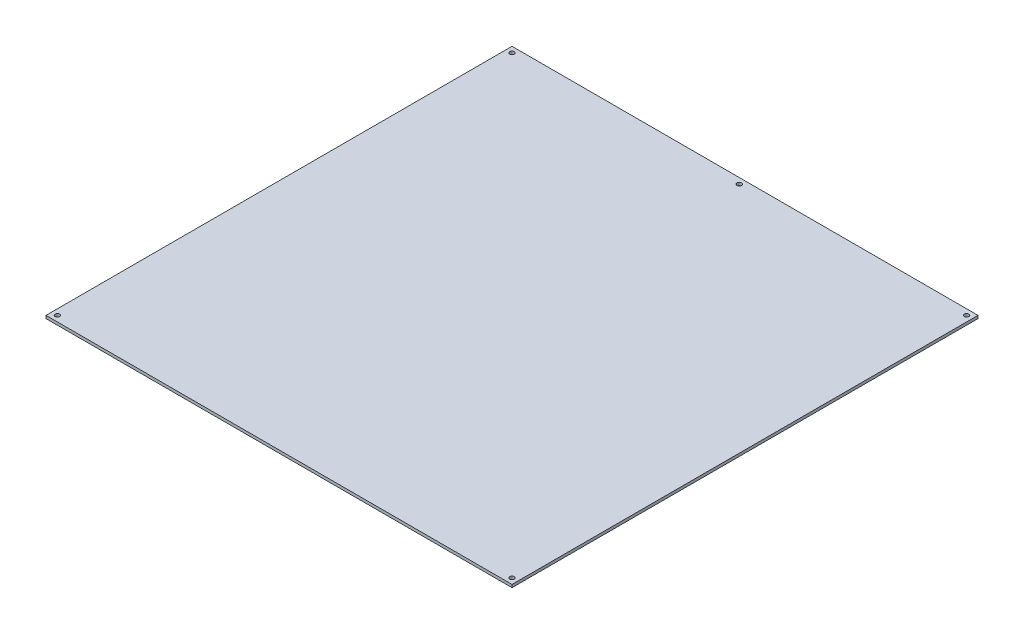
ISO-10303-21;
HEADER;
FILE_DESCRIPTION(('STEP AP214'),'2;1');
FILE_NAME('part.step','',(''),(''),'','','');
FILE_SCHEMA(('AUTOMOTIVE_DESIGN { 1 0 10303 214 1 1 1 1 }'));
ENDSEC;
DATA;
#1=APPLICATION_CONTEXT('core data for automotive mechanical design processes');
#2=APPLICATION_PROTOCOL_DEFINITION('international standard','automotive_design',2000,#1);
#3=PRODUCT_CONTEXT('',#1,'mechanical');
#4=PRODUCT('Part','Part','',(#3));
#5=PRODUCT_RELATED_PRODUCT_CATEGORY('part','',(#4));
#6=PRODUCT_DEFINITION_FORMATION('','',#4);
#7=PRODUCT_DEFINITION_CONTEXT('part definition',#1,'design');
#8=PRODUCT_DEFINITION('design','',#6,#7);
#9=PRODUCT_DEFINITION_SHAPE('','',#8);
#10=(LENGTH_UNIT() NAMED_UNIT(*) SI_UNIT(.MILLI.,.METRE.));
#11=(NAMED_UNIT(*) PLANE_ANGLE_UNIT() SI_UNIT($,.RADIAN.));
#12=(NAMED_UNIT(*) SI_UNIT($,.STERADIAN.) SOLID_ANGLE_UNIT());
#13=UNCERTAINTY_MEASURE_WITH_UNIT(LENGTH_MEASURE(1.E-05),#10,'distance_accuracy_value','');
#14=(GEOMETRIC_REPRESENTATION_CONTEXT(3) GLOBAL_UNCERTAINTY_ASSIGNED_CONTEXT((#13)) GLOBAL_UNIT_ASSIGNED_CONTEXT((#10,
#11,#12)) REPRESENTATION_CONTEXT('',''));
#15=CARTESIAN_POINT('',(0.,0.,0.));
#16=DIRECTION('',(0.,0.,1.));
#17=DIRECTION('',(1.,0.,0.));
#18=AXIS2_PLACEMENT_3D('',#15,#16,#17);
#19=CARTESIAN_POINT('',(0.,0.,0.));
#20=DIRECTION('',(0.,1.,0.));
#21=DIRECTION('',(0.,0.,1.));
#22=AXIS2_PLACEMENT_3D('',#19,#20,#21);
#23=PLANE('',#22);
#24=DIRECTION('',(-1.,0.,0.));
#25=VECTOR('',#24,1.);
#26=CARTESIAN_POINT('',(-163.5,0.,163.5));
#27=LINE('',#26,#25);
#28=CARTESIAN_POINT('',(163.5,0.,163.5));
#29=VERTEX_POINT('',#28);
#30=CARTESIAN_POINT('',(-163.5,0.,163.5));
#31=VERTEX_POINT('',#30);
#32=EDGE_CURVE('E99',#29,#31,#27,.T.);
#33=ORIENTED_EDGE('',*,*,#32,.T.);
#34=DIRECTION('',(0.,0.,-1.));
#35=VECTOR('',#34,1.);
#36=CARTESIAN_POINT('',(-163.5,0.,-163.5));
#37=LINE('',#36,#35);
#38=CARTESIAN_POINT('',(-163.5,0.,-163.5));
#39=VERTEX_POINT('',#38);
#40=EDGE_CURVE('E72',#31,#39,#37,.T.);
#41=ORIENTED_EDGE('',*,*,#40,.T.);
#42=DIRECTION('',(1.,0.,0.));
#43=VECTOR('',#42,1.);
#44=CARTESIAN_POINT('',(-163.5,0.,-163.5));
#45=LINE('',#44,#43);
#46=CARTESIAN_POINT('',(163.5,0.,-163.5));
#47=VERTEX_POINT('',#46);
#48=EDGE_CURVE('E55',#39,#47,#45,.T.);
#49=ORIENTED_EDGE('',*,*,#48,.T.);
#50=DIRECTION('',(0.,0.,1.));
#51=VECTOR('',#50,1.);
#52=CARTESIAN_POINT('',(163.5,0.,-163.5));
#53=LINE('',#52,#51);
#54=EDGE_CURVE('E60',#47,#29,#53,.T.);
#55=ORIENTED_EDGE('',*,*,#54,.T.);
#56=EDGE_LOOP('',(#33,#41,#49,#55));
#57=FACE_BOUND('',#56,.T.);
#58=CARTESIAN_POINT('',(0.,0.,-159.5));
#59=DIRECTION('',(0.,1.,0.));
#60=DIRECTION('',(0.,0.,1.));
#61=AXIS2_PLACEMENT_3D('',#58,#59,#60);
#62=CIRCLE('',#61,1.59999999999999);
#63=CARTESIAN_POINT('',(0.,0.,-157.9));
#64=VERTEX_POINT('',#63);
#65=EDGE_CURVE('E69',#64,#64,#62,.T.);
#66=ORIENTED_EDGE('',*,*,#65,.T.);
#67=EDGE_LOOP('',(#66));
#68=FACE_BOUND('',#67,.T.);
#69=CARTESIAN_POINT('',(-159.5,0.,-159.5));
#70=DIRECTION('',(0.,1.,0.));
#71=DIRECTION('',(0.,0.,1.));
#72=AXIS2_PLACEMENT_3D('',#69,#70,#71);
#73=CIRCLE('',#72,1.59999999999999);
#74=CARTESIAN_POINT('',(-159.5,0.,-157.9));
#75=VERTEX_POINT('',#74);
#76=EDGE_CURVE('E102',#75,#75,#73,.T.);
#77=ORIENTED_EDGE('',*,*,#76,.T.);
#78=EDGE_LOOP('',(#77));
#79=FACE_BOUND('',#78,.T.);
#80=CARTESIAN_POINT('',(159.5,0.,-159.5));
#81=DIRECTION('',(0.,1.,0.));
#82=DIRECTION('',(0.,0.,1.));
#83=AXIS2_PLACEMENT_3D('',#80,#81,#82);
#84=CIRCLE('',#83,1.59999999999999);
#85=CARTESIAN_POINT('',(159.5,0.,-157.9));
#86=VERTEX_POINT('',#85);
#87=EDGE_CURVE('E105',#86,#86,#84,.T.);
#88=ORIENTED_EDGE('',*,*,#87,.T.);
#89=EDGE_LOOP('',(#88));
#90=FACE_BOUND('',#89,.T.);
#91=CARTESIAN_POINT('',(-159.5,0.,159.5));
#92=DIRECTION('',(0.,1.,0.));
#93=DIRECTION('',(0.,0.,1.));
#94=AXIS2_PLACEMENT_3D('',#91,#92,#93);
#95=CIRCLE('',#94,1.59999999999999);
#96=CARTESIAN_POINT('',(-159.5,0.,161.1));
#97=VERTEX_POINT('',#96);
#98=EDGE_CURVE('E107',#97,#97,#95,.T.);
#99=ORIENTED_EDGE('',*,*,#98,.T.);
#100=EDGE_LOOP('',(#99));
#101=FACE_BOUND('',#100,.T.);
#102=CARTESIAN_POINT('',(159.5,0.,159.5));
#103=DIRECTION('',(0.,1.,0.));
#104=DIRECTION('',(0.,0.,1.));
#105=AXIS2_PLACEMENT_3D('',#102,#103,#104);
#106=CIRCLE('',#105,1.59999999999999);
#107=CARTESIAN_POINT('',(159.5,0.,161.1));
#108=VERTEX_POINT('',#107);
#109=EDGE_CURVE('E20',#108,#108,#106,.T.);
#110=ORIENTED_EDGE('',*,*,#109,.T.);
#111=EDGE_LOOP('',(#110));
#112=FACE_BOUND('',#111,.T.);
#113=ADVANCED_FACE('F17',(#57,#68,#79,#90,#101,#112),#23,.F.);
#114=CARTESIAN_POINT('',(159.5,2.,159.5));
#115=DIRECTION('',(0.,1.,0.));
#116=DIRECTION('',(0.,0.,1.));
#117=AXIS2_PLACEMENT_3D('',#114,#115,#116);
#118=CYLINDRICAL_SURFACE('',#117,1.59999999999999);
#119=CARTESIAN_POINT('',(159.5,2.,159.5));
#120=DIRECTION('',(0.,1.,0.));
#121=DIRECTION('',(0.,0.,1.));
#122=AXIS2_PLACEMENT_3D('',#119,#120,#121);
#123=CIRCLE('',#122,1.59999999999999);
#124=CARTESIAN_POINT('',(159.5,2.,161.1));
#125=VERTEX_POINT('',#124);
#126=EDGE_CURVE('E96',#125,#125,#123,.F.);
#127=ORIENTED_EDGE('',*,*,#126,.F.);
#128=EDGE_LOOP('',(#127));
#129=FACE_BOUND('',#128,.T.);
#130=ORIENTED_EDGE('',*,*,#109,.F.);
#131=EDGE_LOOP('',(#130));
#132=FACE_BOUND('',#131,.T.);
#133=ADVANCED_FACE('F115',(#129,#132),#118,.F.);
#134=CARTESIAN_POINT('',(-159.5,2.,159.5));
#135=DIRECTION('',(0.,1.,0.));
#136=DIRECTION('',(0.,0.,1.));
#137=AXIS2_PLACEMENT_3D('',#134,#135,#136);
#138=CYLINDRICAL_SURFACE('',#137,1.59999999999999);
#139=CARTESIAN_POINT('',(-159.5,2.,159.5));
#140=DIRECTION('',(0.,1.,0.));
#141=DIRECTION('',(0.,0.,1.));
#142=AXIS2_PLACEMENT_3D('',#139,#140,#141);
#143=CIRCLE('',#142,1.59999999999999);
#144=CARTESIAN_POINT('',(-159.5,2.,161.1));
#145=VERTEX_POINT('',#144);
#146=EDGE_CURVE('E93',#145,#145,#143,.F.);
#147=ORIENTED_EDGE('',*,*,#146,.F.);
#148=EDGE_LOOP('',(#147));
#149=FACE_BOUND('',#148,.T.);
#150=ORIENTED_EDGE('',*,*,#98,.F.);
#151=EDGE_LOOP('',(#150));
#152=FACE_BOUND('',#151,.T.);
#153=ADVANCED_FACE('F117',(#149,#152),#138,.F.);
#154=CARTESIAN_POINT('',(159.5,2.,-159.5));
#155=DIRECTION('',(0.,1.,0.));
#156=DIRECTION('',(0.,0.,1.));
#157=AXIS2_PLACEMENT_3D('',#154,#155,#156);
#158=CYLINDRICAL_SURFACE('',#157,1.59999999999999);
#159=CARTESIAN_POINT('',(159.5,2.,-159.5));
#160=DIRECTION('',(0.,1.,0.));
#161=DIRECTION('',(0.,0.,1.));
#162=AXIS2_PLACEMENT_3D('',#159,#160,#161);
#163=CIRCLE('',#162,1.59999999999999);
#164=CARTESIAN_POINT('',(159.5,2.,-157.9));
#165=VERTEX_POINT('',#164);
#166=EDGE_CURVE('E90',#165,#165,#163,.F.);
#167=ORIENTED_EDGE('',*,*,#166,.F.);
#168=EDGE_LOOP('',(#167));
#169=FACE_BOUND('',#168,.T.);
#170=ORIENTED_EDGE('',*,*,#87,.F.);
#171=EDGE_LOOP('',(#170));
#172=FACE_BOUND('',#171,.T.);
#173=ADVANCED_FACE('F124',(#169,#172),#158,.F.);
#174=CARTESIAN_POINT('',(-159.5,2.,-159.5));
#175=DIRECTION('',(0.,1.,0.));
#176=DIRECTION('',(0.,0.,1.));
#177=AXIS2_PLACEMENT_3D('',#174,#175,#176);
#178=CYLINDRICAL_SURFACE('',#177,1.59999999999999);
#179=CARTESIAN_POINT('',(-159.5,2.,-159.5));
#180=DIRECTION('',(0.,1.,0.));
#181=DIRECTION('',(0.,0.,1.));
#182=AXIS2_PLACEMENT_3D('',#179,#180,#181);
#183=CIRCLE('',#182,1.59999999999999);
#184=CARTESIAN_POINT('',(-159.5,2.,-157.9));
#185=VERTEX_POINT('',#184);
#186=EDGE_CURVE('E87',#185,#185,#183,.F.);
#187=ORIENTED_EDGE('',*,*,#186,.F.);
#188=EDGE_LOOP('',(#187));
#189=FACE_BOUND('',#188,.T.);
#190=ORIENTED_EDGE('',*,*,#76,.F.);
#191=EDGE_LOOP('',(#190));
#192=FACE_BOUND('',#191,.T.);
#193=ADVANCED_FACE('F151',(#189,#192),#178,.F.);
#194=CARTESIAN_POINT('',(0.,2.,-159.5));
#195=DIRECTION('',(0.,1.,0.));
#196=DIRECTION('',(0.,0.,1.));
#197=AXIS2_PLACEMENT_3D('',#194,#195,#196);
#198=CYLINDRICAL_SURFACE('',#197,1.59999999999999);
#199=CARTESIAN_POINT('',(0.,2.,-159.5));
#200=DIRECTION('',(0.,1.,0.));
#201=DIRECTION('',(0.,0.,1.));
#202=AXIS2_PLACEMENT_3D('',#199,#200,#201);
#203=CIRCLE('',#202,1.59999999999999);
#204=CARTESIAN_POINT('',(0.,2.,-157.9));
#205=VERTEX_POINT('',#204);
#206=EDGE_CURVE('E83',#205,#205,#203,.F.);
#207=ORIENTED_EDGE('',*,*,#206,.F.);
#208=EDGE_LOOP('',(#207));
#209=FACE_BOUND('',#208,.T.);
#210=ORIENTED_EDGE('',*,*,#65,.F.);
#211=EDGE_LOOP('',(#210));
#212=FACE_BOUND('',#211,.T.);
#213=ADVANCED_FACE('F148',(#209,#212),#198,.F.);
#214=CARTESIAN_POINT('',(163.5,2.,-163.5));
#215=DIRECTION('',(-1.,0.,0.));
#216=DIRECTION('',(0.,0.,1.));
#217=AXIS2_PLACEMENT_3D('',#214,#215,#216);
#218=PLANE('',#217);
#219=DIRECTION('',(0.,1.,0.));
#220=VECTOR('',#219,1.);
#221=CARTESIAN_POINT('',(163.5,2.,-163.5));
#222=LINE('',#221,#220);
#223=CARTESIAN_POINT('',(163.5,2.,-163.5));
#224=VERTEX_POINT('',#223);
#225=EDGE_CURVE('E62',#47,#224,#222,.T.);
#226=ORIENTED_EDGE('',*,*,#225,.T.);
#227=DIRECTION('',(0.,0.,1.));
#228=VECTOR('',#227,1.);
#229=CARTESIAN_POINT('',(163.5,2.,0.));
#230=LINE('',#229,#228);
#231=CARTESIAN_POINT('',(163.5,2.,163.5));
#232=VERTEX_POINT('',#231);
#233=EDGE_CURVE('E86',#232,#224,#230,.F.);
#234=ORIENTED_EDGE('',*,*,#233,.F.);
#235=DIRECTION('',(0.,1.,0.));
#236=VECTOR('',#235,1.);
#237=CARTESIAN_POINT('',(163.5,2.,163.5));
#238=LINE('',#237,#236);
#239=EDGE_CURVE('E65',#232,#29,#238,.F.);
#240=ORIENTED_EDGE('',*,*,#239,.T.);
#241=ORIENTED_EDGE('',*,*,#54,.F.);
#242=EDGE_LOOP('',(#226,#234,#240,#241));
#243=FACE_BOUND('',#242,.T.);
#244=ADVANCED_FACE('F61',(#243),#218,.F.);
#245=CARTESIAN_POINT('',(-163.5,2.,-163.5));
#246=DIRECTION('',(0.,0.,1.));
#247=DIRECTION('',(1.,0.,0.));
#248=AXIS2_PLACEMENT_3D('',#245,#246,#247);
#249=PLANE('',#248);
#250=DIRECTION('',(0.,1.,0.));
#251=VECTOR('',#250,1.);
#252=CARTESIAN_POINT('',(-163.5,2.,-163.5));
#253=LINE('',#252,#251);
#254=CARTESIAN_POINT('',(-163.5,2.,-163.5));
#255=VERTEX_POINT('',#254);
#256=EDGE_CURVE('E74',#39,#255,#253,.T.);
#257=ORIENTED_EDGE('',*,*,#256,.T.);
#258=DIRECTION('',(1.,0.,0.));
#259=VECTOR('',#258,1.);
#260=CARTESIAN_POINT('',(0.,2.,-163.5));
#261=LINE('',#260,#259);
#262=EDGE_CURVE('E78',#224,#255,#261,.F.);
#263=ORIENTED_EDGE('',*,*,#262,.F.);
#264=ORIENTED_EDGE('',*,*,#225,.F.);
#265=ORIENTED_EDGE('',*,*,#48,.F.);
#266=EDGE_LOOP('',(#257,#263,#264,#265));
#267=FACE_BOUND('',#266,.T.);
#268=ADVANCED_FACE('F76',(#267),#249,.F.);
#269=CARTESIAN_POINT('',(-163.5,2.,-163.5));
#270=DIRECTION('',(1.,0.,0.));
#271=DIRECTION('',(0.,0.,-1.));
#272=AXIS2_PLACEMENT_3D('',#269,#270,#271);
#273=PLANE('',#272);
#274=DIRECTION('',(0.,1.,0.));
#275=VECTOR('',#274,1.);
#276=CARTESIAN_POINT('',(-163.5,2.,163.5));
#277=LINE('',#276,#275);
#278=CARTESIAN_POINT('',(-163.5,2.,163.5));
#279=VERTEX_POINT('',#278);
#280=EDGE_CURVE('E35',#31,#279,#277,.T.);
#281=ORIENTED_EDGE('',*,*,#280,.T.);
#282=DIRECTION('',(0.,0.,1.));
#283=VECTOR('',#282,1.);
#284=CARTESIAN_POINT('',(-163.5,2.,0.));
#285=LINE('',#284,#283);
#286=EDGE_CURVE('E26',#255,#279,#285,.T.);
#287=ORIENTED_EDGE('',*,*,#286,.F.);
#288=ORIENTED_EDGE('',*,*,#256,.F.);
#289=ORIENTED_EDGE('',*,*,#40,.F.);
#290=EDGE_LOOP('',(#281,#287,#288,#289));
#291=FACE_BOUND('',#290,.T.);
#292=ADVANCED_FACE('F136',(#291),#273,.F.);
#293=CARTESIAN_POINT('',(-163.5,2.,163.5));
#294=DIRECTION('',(0.,0.,-1.));
#295=DIRECTION('',(-1.,0.,0.));
#296=AXIS2_PLACEMENT_3D('',#293,#294,#295);
#297=PLANE('',#296);
#298=ORIENTED_EDGE('',*,*,#239,.F.);
#299=DIRECTION('',(1.,0.,0.));
#300=VECTOR('',#299,1.);
#301=CARTESIAN_POINT('',(0.,2.,163.5));
#302=LINE('',#301,#300);
#303=EDGE_CURVE('E10',#279,#232,#302,.T.);
#304=ORIENTED_EDGE('',*,*,#303,.F.);
#305=ORIENTED_EDGE('',*,*,#280,.F.);
#306=ORIENTED_EDGE('',*,*,#32,.F.);
#307=EDGE_LOOP('',(#298,#304,#305,#306));
#308=FACE_BOUND('',#307,.T.);
#309=ADVANCED_FACE('F130',(#308),#297,.F.);
#310=CARTESIAN_POINT('',(0.,2.,0.));
#311=DIRECTION('',(0.,1.,0.));
#312=DIRECTION('',(0.,0.,1.));
#313=AXIS2_PLACEMENT_3D('',#310,#311,#312);
#314=PLANE('',#313);
#315=ORIENTED_EDGE('',*,*,#286,.T.);
#316=ORIENTED_EDGE('',*,*,#303,.T.);
#317=ORIENTED_EDGE('',*,*,#233,.T.);
#318=ORIENTED_EDGE('',*,*,#262,.T.);
#319=EDGE_LOOP('',(#315,#316,#317,#318));
#320=FACE_BOUND('',#319,.T.);
#321=ORIENTED_EDGE('',*,*,#206,.T.);
#322=EDGE_LOOP('',(#321));
#323=FACE_BOUND('',#322,.T.);
#324=ORIENTED_EDGE('',*,*,#186,.T.);
#325=EDGE_LOOP('',(#324));
#326=FACE_BOUND('',#325,.T.);
#327=ORIENTED_EDGE('',*,*,#166,.T.);
#328=EDGE_LOOP('',(#327));
#329=FACE_BOUND('',#328,.T.);
#330=ORIENTED_EDGE('',*,*,#146,.T.);
#331=EDGE_LOOP('',(#330));
#332=FACE_BOUND('',#331,.T.);
#333=ORIENTED_EDGE('',*,*,#126,.T.);
#334=EDGE_LOOP('',(#333));
#335=FACE_BOUND('',#334,.T.);
#336=ADVANCED_FACE('F128',(#320,#323,#326,#329,#332,#335),#314,.T.);
#337=CLOSED_SHELL('',(#113,#133,#153,#173,#193,#213,#244,#268,#292,#309,#336));
#338=MANIFOLD_SOLID_BREP('B1',#337);
#339=ADVANCED_BREP_SHAPE_REPRESENTATION('',(#18,#338),#14);
#340=SHAPE_DEFINITION_REPRESENTATION(#9,#339);
ENDSEC;
END-ISO-10303-21;
